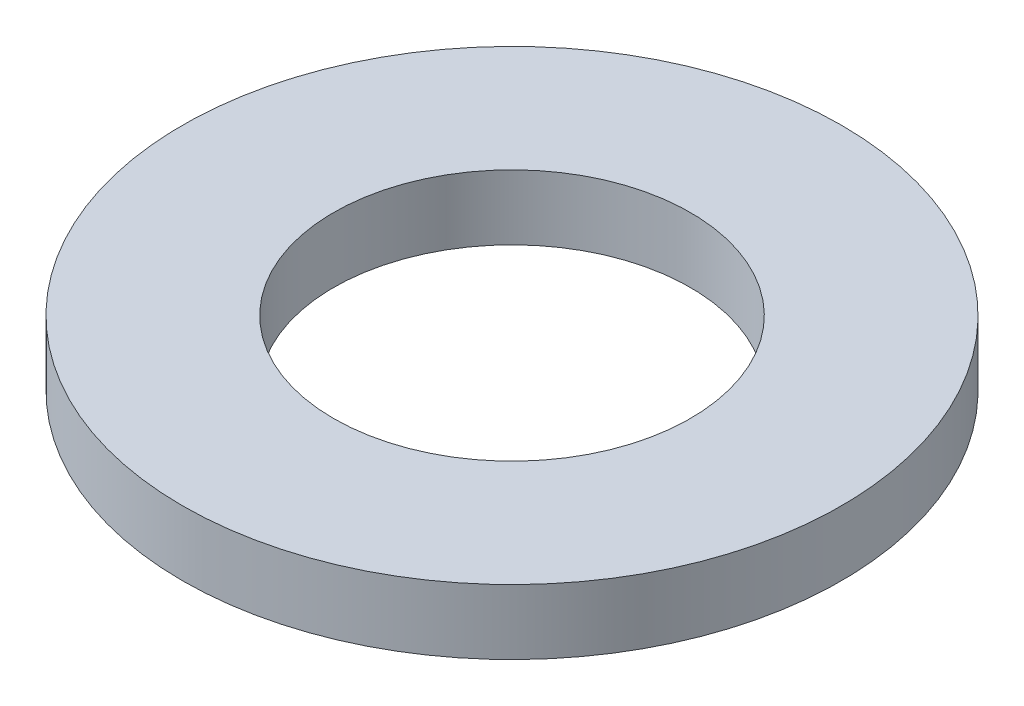
ISO-10303-21;
HEADER;
FILE_DESCRIPTION(('STEP AP214'),'2;1');
FILE_NAME('part.step','',(''),(''),'','','');
FILE_SCHEMA(('AUTOMOTIVE_DESIGN { 1 0 10303 214 1 1 1 1 }'));
ENDSEC;
DATA;
#1=APPLICATION_CONTEXT('core data for automotive mechanical design processes');
#2=APPLICATION_PROTOCOL_DEFINITION('international standard','automotive_design',2000,#1);
#3=PRODUCT_CONTEXT('',#1,'mechanical');
#4=PRODUCT('Part','Part','',(#3));
#5=PRODUCT_RELATED_PRODUCT_CATEGORY('part','',(#4));
#6=PRODUCT_DEFINITION_FORMATION('','',#4);
#7=PRODUCT_DEFINITION_CONTEXT('part definition',#1,'design');
#8=PRODUCT_DEFINITION('design','',#6,#7);
#9=PRODUCT_DEFINITION_SHAPE('','',#8);
#10=(LENGTH_UNIT() NAMED_UNIT(*) SI_UNIT(.MILLI.,.METRE.));
#11=(NAMED_UNIT(*) PLANE_ANGLE_UNIT() SI_UNIT($,.RADIAN.));
#12=(NAMED_UNIT(*) SI_UNIT($,.STERADIAN.) SOLID_ANGLE_UNIT());
#13=UNCERTAINTY_MEASURE_WITH_UNIT(LENGTH_MEASURE(1.E-05),#10,'distance_accuracy_value','');
#14=(GEOMETRIC_REPRESENTATION_CONTEXT(3) GLOBAL_UNCERTAINTY_ASSIGNED_CONTEXT((#13)) GLOBAL_UNIT_ASSIGNED_CONTEXT((#10,
#11,#12)) REPRESENTATION_CONTEXT('',''));
#15=CARTESIAN_POINT('',(0.,0.,0.));
#16=DIRECTION('',(0.,0.,1.));
#17=DIRECTION('',(1.,0.,0.));
#18=AXIS2_PLACEMENT_3D('',#15,#16,#17);
#19=CARTESIAN_POINT('',(0.,7.5,0.));
#20=DIRECTION('',(0.,1.,0.));
#21=DIRECTION('',(0.,0.,1.));
#22=AXIS2_PLACEMENT_3D('',#19,#20,#21);
#23=PLANE('',#22);
#24=CARTESIAN_POINT('',(0.,7.5,0.));
#25=DIRECTION('',(0.,1.,0.));
#26=DIRECTION('',(0.,0.,1.));
#27=AXIS2_PLACEMENT_3D('',#24,#25,#26);
#28=CIRCLE('',#27,38.05);
#29=CARTESIAN_POINT('',(0.,7.5,38.05));
#30=VERTEX_POINT('',#29);
#31=EDGE_CURVE('E10',#30,#30,#28,.T.);
#32=ORIENTED_EDGE('',*,*,#31,.T.);
#33=EDGE_LOOP('',(#32));
#34=FACE_BOUND('',#33,.T.);
#35=CARTESIAN_POINT('',(0.,7.5,0.));
#36=DIRECTION('',(0.,1.,0.));
#37=DIRECTION('',(0.,0.,1.));
#38=AXIS2_PLACEMENT_3D('',#35,#36,#37);
#39=CIRCLE('',#38,20.6);
#40=CARTESIAN_POINT('',(0.,7.5,20.6));
#41=VERTEX_POINT('',#40);
#42=EDGE_CURVE('E50',#41,#41,#39,.T.);
#43=ORIENTED_EDGE('',*,*,#42,.F.);
#44=EDGE_LOOP('',(#43));
#45=FACE_BOUND('',#44,.T.);
#46=ADVANCED_FACE('F37',(#34,#45),#23,.T.);
#47=CARTESIAN_POINT('',(0.,0.,0.));
#48=DIRECTION('',(0.,1.,0.));
#49=DIRECTION('',(0.,0.,1.));
#50=AXIS2_PLACEMENT_3D('',#47,#48,#49);
#51=PLANE('',#50);
#52=CARTESIAN_POINT('',(0.,0.,0.));
#53=DIRECTION('',(0.,1.,0.));
#54=DIRECTION('',(0.,0.,1.));
#55=AXIS2_PLACEMENT_3D('',#52,#53,#54);
#56=CIRCLE('',#55,38.05);
#57=CARTESIAN_POINT('',(0.,0.,38.05));
#58=VERTEX_POINT('',#57);
#59=EDGE_CURVE('E41',#58,#58,#56,.T.);
#60=ORIENTED_EDGE('',*,*,#59,.F.);
#61=EDGE_LOOP('',(#60));
#62=FACE_BOUND('',#61,.T.);
#63=CARTESIAN_POINT('',(0.,0.,0.));
#64=DIRECTION('',(0.,1.,0.));
#65=DIRECTION('',(0.,0.,1.));
#66=AXIS2_PLACEMENT_3D('',#63,#64,#65);
#67=CIRCLE('',#66,20.6);
#68=CARTESIAN_POINT('',(0.,0.,20.6));
#69=VERTEX_POINT('',#68);
#70=EDGE_CURVE('E52',#69,#69,#67,.T.);
#71=ORIENTED_EDGE('',*,*,#70,.T.);
#72=EDGE_LOOP('',(#71));
#73=FACE_BOUND('',#72,.T.);
#74=ADVANCED_FACE('F64',(#62,#73),#51,.F.);
#75=CARTESIAN_POINT('',(0.,7.5,0.));
#76=DIRECTION('',(0.,-1.,0.));
#77=DIRECTION('',(0.,0.,-1.));
#78=AXIS2_PLACEMENT_3D('',#75,#76,#77);
#79=CYLINDRICAL_SURFACE('',#78,38.05);
#80=ORIENTED_EDGE('',*,*,#31,.F.);
#81=EDGE_LOOP('',(#80));
#82=FACE_BOUND('',#81,.T.);
#83=ORIENTED_EDGE('',*,*,#59,.T.);
#84=EDGE_LOOP('',(#83));
#85=FACE_BOUND('',#84,.T.);
#86=ADVANCED_FACE('F39',(#82,#85),#79,.T.);
#87=CARTESIAN_POINT('',(0.,7.5,0.));
#88=DIRECTION('',(0.,-1.,0.));
#89=DIRECTION('',(0.,0.,-1.));
#90=AXIS2_PLACEMENT_3D('',#87,#88,#89);
#91=CYLINDRICAL_SURFACE('',#90,20.6);
#92=ORIENTED_EDGE('',*,*,#42,.T.);
#93=EDGE_LOOP('',(#92));
#94=FACE_BOUND('',#93,.T.);
#95=ORIENTED_EDGE('',*,*,#70,.F.);
#96=EDGE_LOOP('',(#95));
#97=FACE_BOUND('',#96,.T.);
#98=ADVANCED_FACE('F60',(#94,#97),#91,.F.);
#99=CLOSED_SHELL('',(#46,#74,#86,#98));
#100=MANIFOLD_SOLID_BREP('B2',#99);
#101=ADVANCED_BREP_SHAPE_REPRESENTATION('',(#18,#100),#14);
#102=SHAPE_DEFINITION_REPRESENTATION(#9,#101);
ENDSEC;
END-ISO-10303-21;
